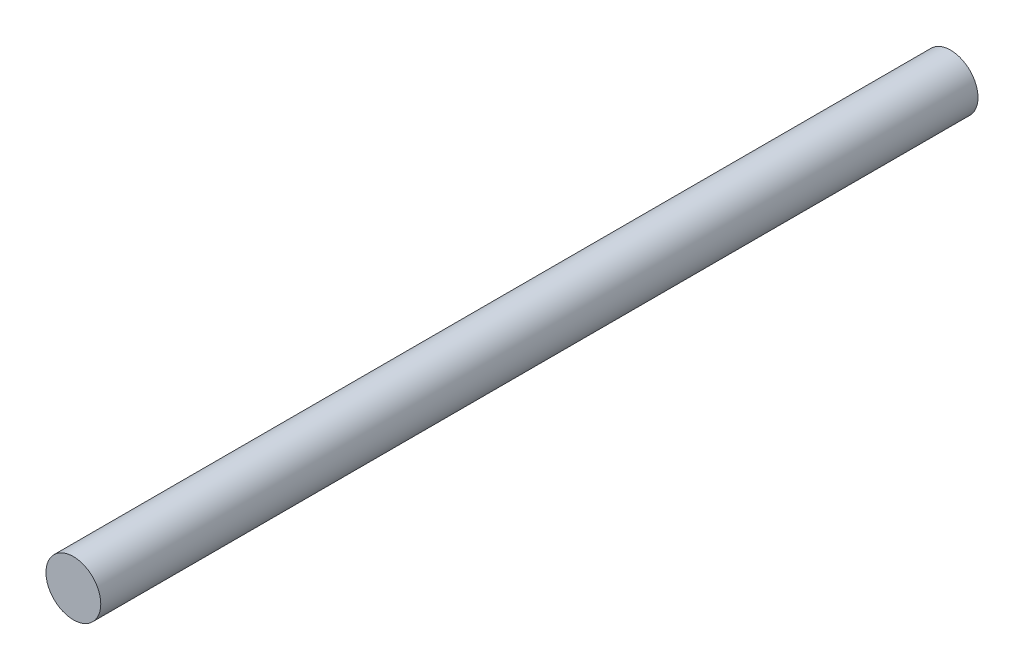
ISO-10303-21;
HEADER;
FILE_DESCRIPTION(('STEP AP214'),'2;1');
FILE_NAME('part.step','',(''),(''),'','','');
FILE_SCHEMA(('AUTOMOTIVE_DESIGN { 1 0 10303 214 1 1 1 1 }'));
ENDSEC;
DATA;
#1=APPLICATION_CONTEXT('core data for automotive mechanical design processes');
#2=APPLICATION_PROTOCOL_DEFINITION('international standard','automotive_design',2000,#1);
#3=PRODUCT_CONTEXT('',#1,'mechanical');
#4=PRODUCT('Part','Part','',(#3));
#5=PRODUCT_RELATED_PRODUCT_CATEGORY('part','',(#4));
#6=PRODUCT_DEFINITION_FORMATION('','',#4);
#7=PRODUCT_DEFINITION_CONTEXT('part definition',#1,'design');
#8=PRODUCT_DEFINITION('design','',#6,#7);
#9=PRODUCT_DEFINITION_SHAPE('','',#8);
#10=(LENGTH_UNIT() NAMED_UNIT(*) SI_UNIT(.MILLI.,.METRE.));
#11=(NAMED_UNIT(*) PLANE_ANGLE_UNIT() SI_UNIT($,.RADIAN.));
#12=(NAMED_UNIT(*) SI_UNIT($,.STERADIAN.) SOLID_ANGLE_UNIT());
#13=UNCERTAINTY_MEASURE_WITH_UNIT(LENGTH_MEASURE(1.E-05),#10,'distance_accuracy_value','');
#14=(GEOMETRIC_REPRESENTATION_CONTEXT(3) GLOBAL_UNCERTAINTY_ASSIGNED_CONTEXT((#13)) GLOBAL_UNIT_ASSIGNED_CONTEXT((#10,
#11,#12)) REPRESENTATION_CONTEXT('',''));
#15=CARTESIAN_POINT('',(0.,0.,0.));
#16=DIRECTION('',(0.,0.,1.));
#17=DIRECTION('',(1.,0.,0.));
#18=AXIS2_PLACEMENT_3D('',#15,#16,#17);
#19=CARTESIAN_POINT('',(0.,0.,50.8));
#20=DIRECTION('',(0.,0.,-1.));
#21=DIRECTION('',(-1.,0.,0.));
#22=AXIS2_PLACEMENT_3D('',#19,#20,#21);
#23=CYLINDRICAL_SURFACE('',#22,3.175);
#24=CARTESIAN_POINT('',(0.,0.,50.8));
#25=DIRECTION('',(0.,0.,1.));
#26=DIRECTION('',(1.,0.,0.));
#27=AXIS2_PLACEMENT_3D('',#24,#25,#26);
#28=CIRCLE('',#27,3.175);
#29=CARTESIAN_POINT('',(3.175,0.,50.8));
#30=VERTEX_POINT('',#29);
#31=EDGE_CURVE('E10',#30,#30,#28,.T.);
#32=ORIENTED_EDGE('',*,*,#31,.F.);
#33=EDGE_LOOP('',(#32));
#34=FACE_BOUND('',#33,.T.);
#35=CARTESIAN_POINT('',(0.,0.,-50.8));
#36=DIRECTION('',(0.,0.,1.));
#37=DIRECTION('',(1.,0.,0.));
#38=AXIS2_PLACEMENT_3D('',#35,#36,#37);
#39=CIRCLE('',#38,3.175);
#40=CARTESIAN_POINT('',(3.175,0.,-50.8));
#41=VERTEX_POINT('',#40);
#42=EDGE_CURVE('E34',#41,#41,#39,.T.);
#43=ORIENTED_EDGE('',*,*,#42,.T.);
#44=EDGE_LOOP('',(#43));
#45=FACE_BOUND('',#44,.T.);
#46=ADVANCED_FACE('F31',(#34,#45),#23,.T.);
#47=CARTESIAN_POINT('',(0.,0.,50.8));
#48=DIRECTION('',(0.,0.,1.));
#49=DIRECTION('',(1.,0.,0.));
#50=AXIS2_PLACEMENT_3D('',#47,#48,#49);
#51=PLANE('',#50);
#52=ORIENTED_EDGE('',*,*,#31,.T.);
#53=EDGE_LOOP('',(#52));
#54=FACE_BOUND('',#53,.T.);
#55=ADVANCED_FACE('F46',(#54),#51,.T.);
#56=CARTESIAN_POINT('',(0.,0.,-50.8));
#57=DIRECTION('',(0.,0.,1.));
#58=DIRECTION('',(1.,0.,0.));
#59=AXIS2_PLACEMENT_3D('',#56,#57,#58);
#60=PLANE('',#59);
#61=ORIENTED_EDGE('',*,*,#42,.F.);
#62=EDGE_LOOP('',(#61));
#63=FACE_BOUND('',#62,.T.);
#64=ADVANCED_FACE('F44',(#63),#60,.F.);
#65=CLOSED_SHELL('',(#46,#55,#64));
#66=MANIFOLD_SOLID_BREP('B2',#65);
#67=ADVANCED_BREP_SHAPE_REPRESENTATION('',(#18,#66),#14);
#68=SHAPE_DEFINITION_REPRESENTATION(#9,#67);
ENDSEC;
END-ISO-10303-21;
